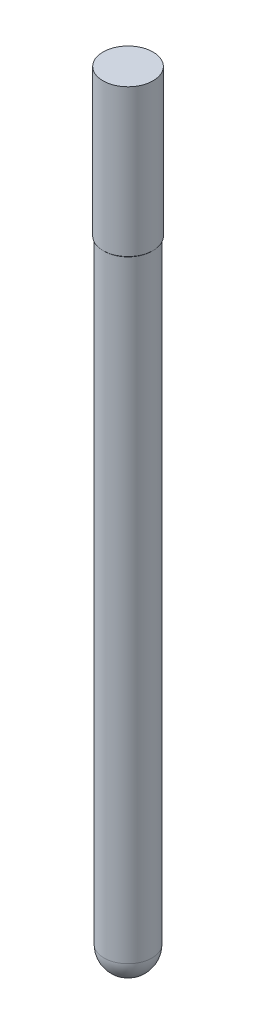
ISO-10303-21;
HEADER;
FILE_DESCRIPTION(('STEP AP214'),'2;1');
FILE_NAME('part.step','',(''),(''),'','','');
FILE_SCHEMA(('AUTOMOTIVE_DESIGN { 1 0 10303 214 1 1 1 1 }'));
ENDSEC;
DATA;
#1=APPLICATION_CONTEXT('core data for automotive mechanical design processes');
#2=APPLICATION_PROTOCOL_DEFINITION('international standard','automotive_design',2000,#1);
#3=PRODUCT_CONTEXT('',#1,'mechanical');
#4=PRODUCT('Part','Part','',(#3));
#5=PRODUCT_RELATED_PRODUCT_CATEGORY('part','',(#4));
#6=PRODUCT_DEFINITION_FORMATION('','',#4);
#7=PRODUCT_DEFINITION_CONTEXT('part definition',#1,'design');
#8=PRODUCT_DEFINITION('design','',#6,#7);
#9=PRODUCT_DEFINITION_SHAPE('','',#8);
#10=(LENGTH_UNIT() NAMED_UNIT(*) SI_UNIT(.MILLI.,.METRE.));
#11=(NAMED_UNIT(*) PLANE_ANGLE_UNIT() SI_UNIT($,.RADIAN.));
#12=(NAMED_UNIT(*) SI_UNIT($,.STERADIAN.) SOLID_ANGLE_UNIT());
#13=UNCERTAINTY_MEASURE_WITH_UNIT(LENGTH_MEASURE(1.E-05),#10,'distance_accuracy_value','');
#14=(GEOMETRIC_REPRESENTATION_CONTEXT(3) GLOBAL_UNCERTAINTY_ASSIGNED_CONTEXT((#13)) GLOBAL_UNIT_ASSIGNED_CONTEXT((#10,
#11,#12)) REPRESENTATION_CONTEXT('',''));
#15=CARTESIAN_POINT('',(0.,0.,0.));
#16=DIRECTION('',(0.,0.,1.));
#17=DIRECTION('',(1.,0.,0.));
#18=AXIS2_PLACEMENT_3D('',#15,#16,#17);
#19=CARTESIAN_POINT('',(0.,2.45000000000001,0.));
#20=DIRECTION('',(0.,-1.,0.));
#21=DIRECTION('',(1.,0.,0.));
#22=AXIS2_PLACEMENT_3D('',#19,#20,#21);
#23=SPHERICAL_SURFACE('',#22,2.45000000000001);
#24=CARTESIAN_POINT('',(0.,2.45000000000001,0.));
#25=DIRECTION('',(0.,-1.,0.));
#26=DIRECTION('',(0.,0.,-1.));
#27=AXIS2_PLACEMENT_3D('',#24,#25,#26);
#28=CIRCLE('',#27,2.45000000000001);
#29=CARTESIAN_POINT('',(0.,2.45000000000001,-2.45000000000001));
#30=VERTEX_POINT('',#29);
#31=EDGE_CURVE('E10',#30,#30,#28,.T.);
#32=ORIENTED_EDGE('',*,*,#31,.T.);
#33=EDGE_LOOP('',(#32));
#34=FACE_BOUND('',#33,.T.);
#35=ADVANCED_FACE('F33',(#34),#23,.T.);
#36=CARTESIAN_POINT('',(0.,0.,0.));
#37=DIRECTION('',(0.,-1.,0.));
#38=DIRECTION('',(0.,0.,-1.));
#39=AXIS2_PLACEMENT_3D('',#36,#37,#38);
#40=CYLINDRICAL_SURFACE('',#39,2.45000000000001);
#41=CARTESIAN_POINT('',(0.,64.9,0.));
#42=DIRECTION('',(0.,-1.,0.));
#43=DIRECTION('',(0.,0.,-1.));
#44=AXIS2_PLACEMENT_3D('',#41,#42,#43);
#45=CIRCLE('',#44,2.45);
#46=CARTESIAN_POINT('',(0.,64.9,-2.45));
#47=VERTEX_POINT('',#46);
#48=EDGE_CURVE('E39',#47,#47,#45,.T.);
#49=ORIENTED_EDGE('',*,*,#48,.T.);
#50=EDGE_LOOP('',(#49));
#51=FACE_BOUND('',#50,.T.);
#52=ORIENTED_EDGE('',*,*,#31,.F.);
#53=EDGE_LOOP('',(#52));
#54=FACE_BOUND('',#53,.T.);
#55=ADVANCED_FACE('F65',(#51,#54),#40,.T.);
#56=CARTESIAN_POINT('',(0.,64.9,0.));
#57=DIRECTION('',(0.,1.,0.));
#58=DIRECTION('',(0.,0.,1.));
#59=AXIS2_PLACEMENT_3D('',#56,#57,#58);
#60=CONICAL_SURFACE('',#59,2.45,0.785398163397429);
#61=CARTESIAN_POINT('',(0.,65.,0.));
#62=DIRECTION('',(0.,-1.,0.));
#63=DIRECTION('',(0.,0.,-1.));
#64=AXIS2_PLACEMENT_3D('',#61,#62,#63);
#65=CIRCLE('',#64,2.55);
#66=CARTESIAN_POINT('',(0.,65.,-2.55));
#67=VERTEX_POINT('',#66);
#68=EDGE_CURVE('E43',#67,#67,#65,.T.);
#69=ORIENTED_EDGE('',*,*,#68,.T.);
#70=EDGE_LOOP('',(#69));
#71=FACE_BOUND('',#70,.T.);
#72=ORIENTED_EDGE('',*,*,#48,.F.);
#73=EDGE_LOOP('',(#72));
#74=FACE_BOUND('',#73,.T.);
#75=ADVANCED_FACE('F62',(#71,#74),#60,.T.);
#76=CARTESIAN_POINT('',(0.,0.,0.));
#77=DIRECTION('',(0.,-1.,0.));
#78=DIRECTION('',(0.,0.,-1.));
#79=AXIS2_PLACEMENT_3D('',#76,#77,#78);
#80=CYLINDRICAL_SURFACE('',#79,2.55);
#81=CARTESIAN_POINT('',(0.,80.,0.));
#82=DIRECTION('',(0.,-1.,0.));
#83=DIRECTION('',(0.,0.,-1.));
#84=AXIS2_PLACEMENT_3D('',#81,#82,#83);
#85=CIRCLE('',#84,2.55);
#86=CARTESIAN_POINT('',(0.,80.,-2.55));
#87=VERTEX_POINT('',#86);
#88=EDGE_CURVE('E47',#87,#87,#85,.T.);
#89=ORIENTED_EDGE('',*,*,#88,.T.);
#90=EDGE_LOOP('',(#89));
#91=FACE_BOUND('',#90,.T.);
#92=ORIENTED_EDGE('',*,*,#68,.F.);
#93=EDGE_LOOP('',(#92));
#94=FACE_BOUND('',#93,.T.);
#95=ADVANCED_FACE('F53',(#91,#94),#80,.T.);
#96=CARTESIAN_POINT('',(0.,80.,0.));
#97=DIRECTION('',(0.,1.,0.));
#98=DIRECTION('',(0.,0.,1.));
#99=AXIS2_PLACEMENT_3D('',#96,#97,#98);
#100=PLANE('',#99);
#101=ORIENTED_EDGE('',*,*,#88,.F.);
#102=EDGE_LOOP('',(#101));
#103=FACE_BOUND('',#102,.T.);
#104=ADVANCED_FACE('F56',(#103),#100,.T.);
#105=CLOSED_SHELL('',(#35,#55,#75,#95,#104));
#106=MANIFOLD_SOLID_BREP('B2',#105);
#107=ADVANCED_BREP_SHAPE_REPRESENTATION('',(#18,#106),#14);
#108=SHAPE_DEFINITION_REPRESENTATION(#9,#107);
ENDSEC;
END-ISO-10303-21;
